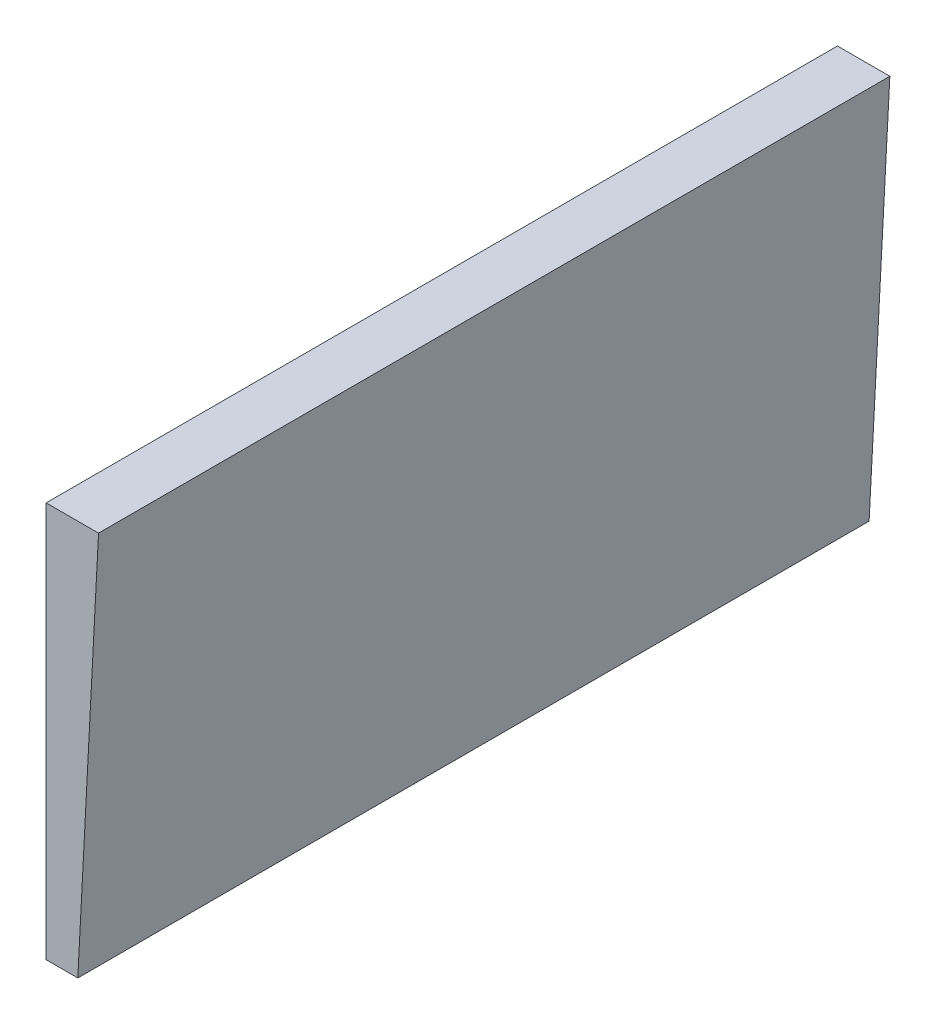
ISO-10303-21;
HEADER;
FILE_DESCRIPTION(('STEP AP214'),'2;1');
FILE_NAME('part.step','',(''),(''),'','','');
FILE_SCHEMA(('AUTOMOTIVE_DESIGN { 1 0 10303 214 1 1 1 1 }'));
ENDSEC;
DATA;
#1=APPLICATION_CONTEXT('core data for automotive mechanical design processes');
#2=APPLICATION_PROTOCOL_DEFINITION('international standard','automotive_design',2000,#1);
#3=PRODUCT_CONTEXT('',#1,'mechanical');
#4=PRODUCT('Part','Part','',(#3));
#5=PRODUCT_RELATED_PRODUCT_CATEGORY('part','',(#4));
#6=PRODUCT_DEFINITION_FORMATION('','',#4);
#7=PRODUCT_DEFINITION_CONTEXT('part definition',#1,'design');
#8=PRODUCT_DEFINITION('design','',#6,#7);
#9=PRODUCT_DEFINITION_SHAPE('','',#8);
#10=(LENGTH_UNIT() NAMED_UNIT(*) SI_UNIT(.MILLI.,.METRE.));
#11=(NAMED_UNIT(*) PLANE_ANGLE_UNIT() SI_UNIT($,.RADIAN.));
#12=(NAMED_UNIT(*) SI_UNIT($,.STERADIAN.) SOLID_ANGLE_UNIT());
#13=UNCERTAINTY_MEASURE_WITH_UNIT(LENGTH_MEASURE(1.E-05),#10,'distance_accuracy_value','');
#14=(GEOMETRIC_REPRESENTATION_CONTEXT(3) GLOBAL_UNCERTAINTY_ASSIGNED_CONTEXT((#13)) GLOBAL_UNIT_ASSIGNED_CONTEXT((#10,
#11,#12)) REPRESENTATION_CONTEXT('',''));
#15=CARTESIAN_POINT('',(0.,0.,0.));
#16=DIRECTION('',(0.,0.,1.));
#17=DIRECTION('',(1.,0.,0.));
#18=AXIS2_PLACEMENT_3D('',#15,#16,#17);
#19=CARTESIAN_POINT('',(-2.,25.,50.));
#20=DIRECTION('',(1.,0.,0.));
#21=DIRECTION('',(0.,1.,0.));
#22=AXIS2_PLACEMENT_3D('',#19,#20,#21);
#23=PLANE('',#22);
#24=DIRECTION('',(0.,-1.,0.));
#25=VECTOR('',#24,1.);
#26=CARTESIAN_POINT('',(-2.,25.,0.));
#27=LINE('',#26,#25);
#28=CARTESIAN_POINT('',(-2.,25.,0.));
#29=VERTEX_POINT('',#28);
#30=CARTESIAN_POINT('',(-2.,0.,0.));
#31=VERTEX_POINT('',#30);
#32=EDGE_CURVE('E87',#29,#31,#27,.T.);
#33=ORIENTED_EDGE('',*,*,#32,.T.);
#34=DIRECTION('',(0.,0.,-1.));
#35=VECTOR('',#34,1.);
#36=CARTESIAN_POINT('',(-2.,0.,50.));
#37=LINE('',#36,#35);
#38=CARTESIAN_POINT('',(-2.,0.,50.));
#39=VERTEX_POINT('',#38);
#40=EDGE_CURVE('E41',#39,#31,#37,.T.);
#41=ORIENTED_EDGE('',*,*,#40,.F.);
#42=DIRECTION('',(0.,-1.,0.));
#43=VECTOR('',#42,1.);
#44=CARTESIAN_POINT('',(-2.,25.,50.));
#45=LINE('',#44,#43);
#46=CARTESIAN_POINT('',(-2.,25.,50.));
#47=VERTEX_POINT('',#46);
#48=EDGE_CURVE('E80',#47,#39,#45,.T.);
#49=ORIENTED_EDGE('',*,*,#48,.F.);
#50=DIRECTION('',(0.,0.,-1.));
#51=VECTOR('',#50,1.);
#52=CARTESIAN_POINT('',(-2.,25.,50.));
#53=LINE('',#52,#51);
#54=EDGE_CURVE('E11',#47,#29,#53,.T.);
#55=ORIENTED_EDGE('',*,*,#54,.T.);
#56=EDGE_LOOP('',(#33,#41,#49,#55));
#57=FACE_BOUND('',#56,.T.);
#58=ADVANCED_FACE('F33',(#57),#23,.F.);
#59=CARTESIAN_POINT('',(-2.,0.,50.));
#60=DIRECTION('',(0.,1.,0.));
#61=DIRECTION('',(-1.,0.,0.));
#62=AXIS2_PLACEMENT_3D('',#59,#60,#61);
#63=PLANE('',#62);
#64=DIRECTION('',(1.,0.,0.));
#65=VECTOR('',#64,1.);
#66=CARTESIAN_POINT('',(-2.,0.,0.));
#67=LINE('',#66,#65);
#68=CARTESIAN_POINT('',(0.,0.,0.));
#69=VERTEX_POINT('',#68);
#70=EDGE_CURVE('E67',#31,#69,#67,.T.);
#71=ORIENTED_EDGE('',*,*,#70,.T.);
#72=DIRECTION('',(0.,0.,-1.));
#73=VECTOR('',#72,1.);
#74=CARTESIAN_POINT('',(0.,0.,50.));
#75=LINE('',#74,#73);
#76=CARTESIAN_POINT('',(0.,0.,50.));
#77=VERTEX_POINT('',#76);
#78=EDGE_CURVE('E88',#77,#69,#75,.T.);
#79=ORIENTED_EDGE('',*,*,#78,.F.);
#80=DIRECTION('',(1.,0.,0.));
#81=VECTOR('',#80,1.);
#82=CARTESIAN_POINT('',(-2.,0.,50.));
#83=LINE('',#82,#81);
#84=EDGE_CURVE('E84',#39,#77,#83,.T.);
#85=ORIENTED_EDGE('',*,*,#84,.F.);
#86=ORIENTED_EDGE('',*,*,#40,.T.);
#87=EDGE_LOOP('',(#71,#79,#85,#86));
#88=FACE_BOUND('',#87,.T.);
#89=ADVANCED_FACE('F89',(#88),#63,.F.);
#90=CARTESIAN_POINT('',(0.,0.,50.));
#91=DIRECTION('',(-0.998629534754574,0.0523359562429368,0.));
#92=DIRECTION('',(-0.0523359562429368,-0.998629534754574,0.));
#93=AXIS2_PLACEMENT_3D('',#90,#91,#92);
#94=PLANE('',#93);
#95=DIRECTION('',(0.0523359562429368,0.998629534754574,0.));
#96=VECTOR('',#95,1.);
#97=CARTESIAN_POINT('',(0.,0.,0.));
#98=LINE('',#97,#96);
#99=CARTESIAN_POINT('',(1.31019448207585,25.,0.));
#100=VERTEX_POINT('',#99);
#101=EDGE_CURVE('E74',#69,#100,#98,.T.);
#102=ORIENTED_EDGE('',*,*,#101,.T.);
#103=DIRECTION('',(0.,0.,-1.));
#104=VECTOR('',#103,1.);
#105=CARTESIAN_POINT('',(1.31019448207585,25.,50.));
#106=LINE('',#105,#104);
#107=CARTESIAN_POINT('',(1.31019448207585,25.,50.));
#108=VERTEX_POINT('',#107);
#109=EDGE_CURVE('E93',#108,#100,#106,.T.);
#110=ORIENTED_EDGE('',*,*,#109,.F.);
#111=DIRECTION('',(0.0523359562429368,0.998629534754574,0.));
#112=VECTOR('',#111,1.);
#113=CARTESIAN_POINT('',(0.,0.,50.));
#114=LINE('',#113,#112);
#115=EDGE_CURVE('E91',#77,#108,#114,.T.);
#116=ORIENTED_EDGE('',*,*,#115,.F.);
#117=ORIENTED_EDGE('',*,*,#78,.T.);
#118=EDGE_LOOP('',(#102,#110,#116,#117));
#119=FACE_BOUND('',#118,.T.);
#120=ADVANCED_FACE('F103',(#119),#94,.F.);
#121=CARTESIAN_POINT('',(1.31019448207585,25.,50.));
#122=DIRECTION('',(0.,-1.,0.));
#123=DIRECTION('',(0.,0.,-1.));
#124=AXIS2_PLACEMENT_3D('',#121,#122,#123);
#125=PLANE('',#124);
#126=DIRECTION('',(-1.,0.,0.));
#127=VECTOR('',#126,1.);
#128=CARTESIAN_POINT('',(1.31019448207585,25.,0.));
#129=LINE('',#128,#127);
#130=EDGE_CURVE('E100',#100,#29,#129,.T.);
#131=ORIENTED_EDGE('',*,*,#130,.T.);
#132=ORIENTED_EDGE('',*,*,#54,.F.);
#133=DIRECTION('',(-1.,0.,0.));
#134=VECTOR('',#133,1.);
#135=CARTESIAN_POINT('',(0.,25.,50.));
#136=LINE('',#135,#134);
#137=EDGE_CURVE('E49',#108,#47,#136,.T.);
#138=ORIENTED_EDGE('',*,*,#137,.F.);
#139=ORIENTED_EDGE('',*,*,#109,.T.);
#140=EDGE_LOOP('',(#131,#132,#138,#139));
#141=FACE_BOUND('',#140,.T.);
#142=ADVANCED_FACE('F107',(#141),#125,.F.);
#143=CARTESIAN_POINT('',(0.,0.,50.));
#144=DIRECTION('',(0.,0.,1.));
#145=DIRECTION('',(1.,0.,0.));
#146=AXIS2_PLACEMENT_3D('',#143,#144,#145);
#147=PLANE('',#146);
#148=ORIENTED_EDGE('',*,*,#137,.T.);
#149=ORIENTED_EDGE('',*,*,#48,.T.);
#150=ORIENTED_EDGE('',*,*,#84,.T.);
#151=ORIENTED_EDGE('',*,*,#115,.T.);
#152=EDGE_LOOP('',(#148,#149,#150,#151));
#153=FACE_BOUND('',#152,.T.);
#154=ADVANCED_FACE('F82',(#153),#147,.T.);
#155=CARTESIAN_POINT('',(0.,0.,0.));
#156=DIRECTION('',(0.,0.,1.));
#157=DIRECTION('',(1.,0.,0.));
#158=AXIS2_PLACEMENT_3D('',#155,#156,#157);
#159=PLANE('',#158);
#160=ORIENTED_EDGE('',*,*,#32,.F.);
#161=ORIENTED_EDGE('',*,*,#130,.F.);
#162=ORIENTED_EDGE('',*,*,#101,.F.);
#163=ORIENTED_EDGE('',*,*,#70,.F.);
#164=EDGE_LOOP('',(#160,#161,#162,#163));
#165=FACE_BOUND('',#164,.T.);
#166=ADVANCED_FACE('F106',(#165),#159,.F.);
#167=CLOSED_SHELL('',(#58,#89,#120,#142,#154,#166));
#168=MANIFOLD_SOLID_BREP('B2',#167);
#169=ADVANCED_BREP_SHAPE_REPRESENTATION('',(#18,#168),#14);
#170=SHAPE_DEFINITION_REPRESENTATION(#9,#169);
ENDSEC;
END-ISO-10303-21;
